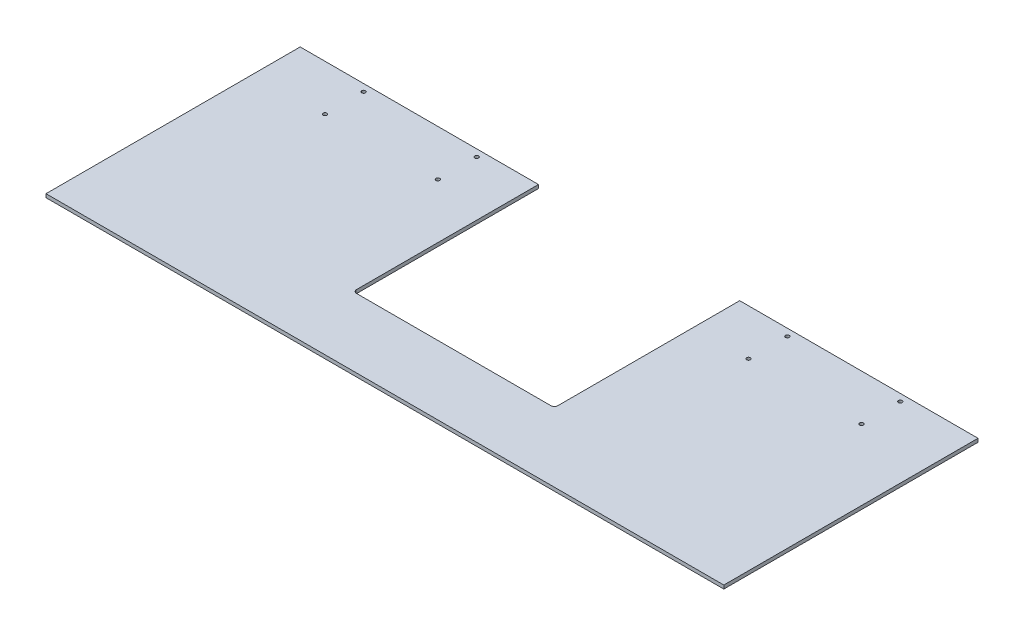
ISO-10303-21;
HEADER;
FILE_DESCRIPTION(('STEP AP214'),'2;1');
FILE_NAME('part.step','',(''),(''),'','','');
FILE_SCHEMA(('AUTOMOTIVE_DESIGN { 1 0 10303 214 1 1 1 1 }'));
ENDSEC;
DATA;
#1=APPLICATION_CONTEXT('core data for automotive mechanical design processes');
#2=APPLICATION_PROTOCOL_DEFINITION('international standard','automotive_design',2000,#1);
#3=PRODUCT_CONTEXT('',#1,'mechanical');
#4=PRODUCT('Part','Part','',(#3));
#5=PRODUCT_RELATED_PRODUCT_CATEGORY('part','',(#4));
#6=PRODUCT_DEFINITION_FORMATION('','',#4);
#7=PRODUCT_DEFINITION_CONTEXT('part definition',#1,'design');
#8=PRODUCT_DEFINITION('design','',#6,#7);
#9=PRODUCT_DEFINITION_SHAPE('','',#8);
#10=(LENGTH_UNIT() NAMED_UNIT(*) SI_UNIT(.MILLI.,.METRE.));
#11=(NAMED_UNIT(*) PLANE_ANGLE_UNIT() SI_UNIT($,.RADIAN.));
#12=(NAMED_UNIT(*) SI_UNIT($,.STERADIAN.) SOLID_ANGLE_UNIT());
#13=UNCERTAINTY_MEASURE_WITH_UNIT(LENGTH_MEASURE(1.E-05),#10,'distance_accuracy_value','');
#14=(GEOMETRIC_REPRESENTATION_CONTEXT(3) GLOBAL_UNCERTAINTY_ASSIGNED_CONTEXT((#13)) GLOBAL_UNIT_ASSIGNED_CONTEXT((#10,
#11,#12)) REPRESENTATION_CONTEXT('',''));
#15=CARTESIAN_POINT('',(0.,0.,0.));
#16=DIRECTION('',(0.,0.,1.));
#17=DIRECTION('',(1.,0.,0.));
#18=AXIS2_PLACEMENT_3D('',#15,#16,#17);
#19=CARTESIAN_POINT('',(609.6,-6.35,-432.563424110412));
#20=DIRECTION('',(0.,0.,1.));
#21=DIRECTION('',(1.,0.,0.));
#22=AXIS2_PLACEMENT_3D('',#19,#20,#21);
#23=PLANE('',#22);
#24=DIRECTION('',(0.,-1.,0.));
#25=VECTOR('',#24,1.);
#26=CARTESIAN_POINT('',(790.575,1340.49866482759,-432.563424110412));
#27=LINE('',#26,#25);
#28=CARTESIAN_POINT('',(790.575,0.,-432.563424110412));
#29=VERTEX_POINT('',#28);
#30=CARTESIAN_POINT('',(790.575,-6.35,-432.563424110412));
#31=VERTEX_POINT('',#30);
#32=EDGE_CURVE('E125',#29,#31,#27,.T.);
#33=ORIENTED_EDGE('',*,*,#32,.F.);
#34=DIRECTION('',(1.,0.,0.));
#35=VECTOR('',#34,1.);
#36=CARTESIAN_POINT('',(609.6,0.,-432.563424110412));
#37=LINE('',#36,#35);
#38=CARTESIAN_POINT('',(1219.2,0.,-432.563424110412));
#39=VERTEX_POINT('',#38);
#40=EDGE_CURVE('E165',#29,#39,#37,.T.);
#41=ORIENTED_EDGE('',*,*,#40,.T.);
#42=DIRECTION('',(0.,1.,0.));
#43=VECTOR('',#42,1.);
#44=CARTESIAN_POINT('',(1219.2,-6.35,-432.563424110412));
#45=LINE('',#44,#43);
#46=CARTESIAN_POINT('',(1219.2,-6.35,-432.563424110412));
#47=VERTEX_POINT('',#46);
#48=EDGE_CURVE('E175',#47,#39,#45,.T.);
#49=ORIENTED_EDGE('',*,*,#48,.F.);
#50=DIRECTION('',(1.,0.,0.));
#51=VECTOR('',#50,1.);
#52=CARTESIAN_POINT('',(609.6,-6.35,-432.563424110412));
#53=LINE('',#52,#51);
#54=EDGE_CURVE('E146',#31,#47,#53,.T.);
#55=ORIENTED_EDGE('',*,*,#54,.F.);
#56=EDGE_LOOP('',(#33,#41,#49,#55));
#57=FACE_BOUND('',#56,.T.);
#58=ADVANCED_FACE('F16',(#57),#23,.F.);
#59=CARTESIAN_POINT('',(609.6,-6.35,-203.963424110413));
#60=DIRECTION('',(0.,-1.,0.));
#61=DIRECTION('',(1.,0.,0.));
#62=AXIS2_PLACEMENT_3D('',#59,#60,#61);
#63=PLANE('',#62);
#64=CARTESIAN_POINT('',(1092.2,-6.35000000000008,-350.013424110413));
#65=DIRECTION('',(0.,-1.,0.));
#66=DIRECTION('',(0.,0.,-1.));
#67=AXIS2_PLACEMENT_3D('',#64,#65,#66);
#68=CIRCLE('',#67,3.36549999999991);
#69=CARTESIAN_POINT('',(1092.2,-6.35000000000008,-353.378924110413));
#70=VERTEX_POINT('',#69);
#71=EDGE_CURVE('E235',#70,#70,#68,.T.);
#72=ORIENTED_EDGE('',*,*,#71,.F.);
#73=EDGE_LOOP('',(#72));
#74=FACE_BOUND('',#73,.T.);
#75=CARTESIAN_POINT('',(1092.2,-6.35000000000008,-419.863424110413));
#76=DIRECTION('',(0.,-1.,0.));
#77=DIRECTION('',(0.,0.,-1.));
#78=AXIS2_PLACEMENT_3D('',#75,#76,#77);
#79=CIRCLE('',#78,3.36549999999991);
#80=CARTESIAN_POINT('',(1092.2,-6.35000000000008,-423.228924110413));
#81=VERTEX_POINT('',#80);
#82=EDGE_CURVE('E230',#81,#81,#79,.T.);
#83=ORIENTED_EDGE('',*,*,#82,.F.);
#84=EDGE_LOOP('',(#83));
#85=FACE_BOUND('',#84,.T.);
#86=CARTESIAN_POINT('',(889.,-6.35000000000008,-419.863424110412));
#87=DIRECTION('',(0.,-1.,0.));
#88=DIRECTION('',(0.,0.,-1.));
#89=AXIS2_PLACEMENT_3D('',#86,#87,#88);
#90=CIRCLE('',#89,3.3655);
#91=CARTESIAN_POINT('',(889.,-6.35000000000008,-423.228924110412));
#92=VERTEX_POINT('',#91);
#93=EDGE_CURVE('E225',#92,#92,#90,.T.);
#94=ORIENTED_EDGE('',*,*,#93,.F.);
#95=EDGE_LOOP('',(#94));
#96=FACE_BOUND('',#95,.T.);
#97=CARTESIAN_POINT('',(889.,-6.35000000000008,-350.013424110413));
#98=DIRECTION('',(0.,-1.,0.));
#99=DIRECTION('',(0.,0.,-1.));
#100=AXIS2_PLACEMENT_3D('',#97,#98,#99);
#101=CIRCLE('',#100,3.3655);
#102=CARTESIAN_POINT('',(889.,-6.35000000000008,-353.378924110413));
#103=VERTEX_POINT('',#102);
#104=EDGE_CURVE('E220',#103,#103,#101,.T.);
#105=ORIENTED_EDGE('',*,*,#104,.F.);
#106=EDGE_LOOP('',(#105));
#107=FACE_BOUND('',#106,.T.);
#108=CARTESIAN_POINT('',(330.2,-6.35000000000008,-350.013424110413));
#109=DIRECTION('',(0.,-1.,0.));
#110=DIRECTION('',(0.,0.,-1.));
#111=AXIS2_PLACEMENT_3D('',#108,#109,#110);
#112=CIRCLE('',#111,3.3655);
#113=CARTESIAN_POINT('',(330.2,-6.35000000000008,-353.378924110413));
#114=VERTEX_POINT('',#113);
#115=EDGE_CURVE('E215',#114,#114,#112,.T.);
#116=ORIENTED_EDGE('',*,*,#115,.F.);
#117=EDGE_LOOP('',(#116));
#118=FACE_BOUND('',#117,.T.);
#119=CARTESIAN_POINT('',(330.2,-6.35000000000008,-419.863424110412));
#120=DIRECTION('',(0.,-1.,0.));
#121=DIRECTION('',(0.,0.,-1.));
#122=AXIS2_PLACEMENT_3D('',#119,#120,#121);
#123=CIRCLE('',#122,3.3655);
#124=CARTESIAN_POINT('',(330.2,-6.35000000000008,-423.228924110412));
#125=VERTEX_POINT('',#124);
#126=EDGE_CURVE('E211',#125,#125,#123,.T.);
#127=ORIENTED_EDGE('',*,*,#126,.F.);
#128=EDGE_LOOP('',(#127));
#129=FACE_BOUND('',#128,.T.);
#130=CARTESIAN_POINT('',(127.,-6.35000000000008,-419.863424110412));
#131=DIRECTION('',(0.,-1.,0.));
#132=DIRECTION('',(0.,0.,-1.));
#133=AXIS2_PLACEMENT_3D('',#130,#131,#132);
#134=CIRCLE('',#133,3.3655);
#135=CARTESIAN_POINT('',(127.,-6.35000000000008,-423.228924110412));
#136=VERTEX_POINT('',#135);
#137=EDGE_CURVE('E206',#136,#136,#134,.T.);
#138=ORIENTED_EDGE('',*,*,#137,.F.);
#139=EDGE_LOOP('',(#138));
#140=FACE_BOUND('',#139,.T.);
#141=CARTESIAN_POINT('',(127.,-6.35000000000008,-350.013424110413));
#142=DIRECTION('',(0.,-1.,0.));
#143=DIRECTION('',(0.,0.,-1.));
#144=AXIS2_PLACEMENT_3D('',#141,#142,#143);
#145=CIRCLE('',#144,3.3655);
#146=CARTESIAN_POINT('',(127.,-6.35000000000008,-353.378924110413));
#147=VERTEX_POINT('',#146);
#148=EDGE_CURVE('E201',#147,#147,#145,.T.);
#149=ORIENTED_EDGE('',*,*,#148,.F.);
#150=EDGE_LOOP('',(#149));
#151=FACE_BOUND('',#150,.T.);
#152=DIRECTION('',(0.,0.,1.));
#153=VECTOR('',#152,1.);
#154=CARTESIAN_POINT('',(428.625,-6.35,-282.531552016735));
#155=LINE('',#154,#153);
#156=CARTESIAN_POINT('',(428.625,-6.35,-432.563424110412));
#157=VERTEX_POINT('',#156);
#158=CARTESIAN_POINT('',(428.625,-6.35,-105.538424110413));
#159=VERTEX_POINT('',#158);
#160=EDGE_CURVE('E117',#157,#159,#155,.T.);
#161=ORIENTED_EDGE('',*,*,#160,.T.);
#162=CARTESIAN_POINT('',(434.975,-6.35000000000008,-105.538424110413));
#163=DIRECTION('',(0.,-1.,0.));
#164=DIRECTION('',(0.,0.,-1.));
#165=AXIS2_PLACEMENT_3D('',#162,#163,#164);
#166=CIRCLE('',#165,6.35);
#167=CARTESIAN_POINT('',(434.975,-6.35,-99.1884241104126));
#168=VERTEX_POINT('',#167);
#169=EDGE_CURVE('E25',#159,#168,#166,.F.);
#170=ORIENTED_EDGE('',*,*,#169,.T.);
#171=DIRECTION('',(1.,0.,0.));
#172=VECTOR('',#171,1.);
#173=CARTESIAN_POINT('',(475.085129356384,-6.35,-99.1884241104126));
#174=LINE('',#173,#172);
#175=CARTESIAN_POINT('',(784.225,-6.35,-99.1884241104126));
#176=VERTEX_POINT('',#175);
#177=EDGE_CURVE('E126',#168,#176,#174,.T.);
#178=ORIENTED_EDGE('',*,*,#177,.T.);
#179=CARTESIAN_POINT('',(784.225,-6.35000000000008,-105.538424110413));
#180=DIRECTION('',(0.,-1.,0.));
#181=DIRECTION('',(0.,0.,-1.));
#182=AXIS2_PLACEMENT_3D('',#179,#180,#181);
#183=CIRCLE('',#182,6.35);
#184=CARTESIAN_POINT('',(790.575,-6.35,-105.538424110413));
#185=VERTEX_POINT('',#184);
#186=EDGE_CURVE('E247',#176,#185,#183,.F.);
#187=ORIENTED_EDGE('',*,*,#186,.T.);
#188=DIRECTION('',(0.,0.,-1.));
#189=VECTOR('',#188,1.);
#190=CARTESIAN_POINT('',(790.575,-6.35,-258.876107633114));
#191=LINE('',#190,#189);
#192=EDGE_CURVE('E200',#185,#31,#191,.T.);
#193=ORIENTED_EDGE('',*,*,#192,.T.);
#194=ORIENTED_EDGE('',*,*,#54,.T.);
#195=DIRECTION('',(0.,0.,-1.));
#196=VECTOR('',#195,1.);
#197=CARTESIAN_POINT('',(1219.2,-6.35,-203.963424110413));
#198=LINE('',#197,#196);
#199=CARTESIAN_POINT('',(1219.2,-6.35,24.6365758895875));
#200=VERTEX_POINT('',#199);
#201=EDGE_CURVE('E145',#200,#47,#198,.T.);
#202=ORIENTED_EDGE('',*,*,#201,.F.);
#203=DIRECTION('',(1.,0.,0.));
#204=VECTOR('',#203,1.);
#205=CARTESIAN_POINT('',(609.6,-6.35,24.6365758895875));
#206=LINE('',#205,#204);
#207=CARTESIAN_POINT('',(0.,-6.35,24.6365758895875));
#208=VERTEX_POINT('',#207);
#209=EDGE_CURVE('E172',#208,#200,#206,.T.);
#210=ORIENTED_EDGE('',*,*,#209,.F.);
#211=DIRECTION('',(0.,0.,-1.));
#212=VECTOR('',#211,1.);
#213=CARTESIAN_POINT('',(0.,-6.35,-203.963424110413));
#214=LINE('',#213,#212);
#215=CARTESIAN_POINT('',(0.,-6.35,-432.563424110412));
#216=VERTEX_POINT('',#215);
#217=EDGE_CURVE('E142',#208,#216,#214,.T.);
#218=ORIENTED_EDGE('',*,*,#217,.T.);
#219=EDGE_CURVE('E133',#216,#157,#53,.T.);
#220=ORIENTED_EDGE('',*,*,#219,.T.);
#221=EDGE_LOOP('',(#161,#170,#178,#187,#193,#194,#202,#210,#218,#220));
#222=FACE_BOUND('',#221,.T.);
#223=ADVANCED_FACE('F139',(#74,#85,#96,#107,#118,#129,#140,#151,#222),#63,.T.);
#224=CARTESIAN_POINT('',(609.6,0.,-203.963424110413));
#225=DIRECTION('',(0.,-1.,0.));
#226=DIRECTION('',(1.,0.,0.));
#227=AXIS2_PLACEMENT_3D('',#224,#225,#226);
#228=PLANE('',#227);
#229=CARTESIAN_POINT('',(1092.2,0.,-350.013424110413));
#230=DIRECTION('',(0.,-1.,0.));
#231=DIRECTION('',(0.,0.,-1.));
#232=AXIS2_PLACEMENT_3D('',#229,#230,#231);
#233=CIRCLE('',#232,3.36549999999991);
#234=CARTESIAN_POINT('',(1092.2,0.,-353.378924110413));
#235=VERTEX_POINT('',#234);
#236=EDGE_CURVE('E231',#235,#235,#233,.F.);
#237=ORIENTED_EDGE('',*,*,#236,.F.);
#238=EDGE_LOOP('',(#237));
#239=FACE_BOUND('',#238,.T.);
#240=CARTESIAN_POINT('',(1092.2,0.,-419.863424110413));
#241=DIRECTION('',(0.,-1.,0.));
#242=DIRECTION('',(0.,0.,-1.));
#243=AXIS2_PLACEMENT_3D('',#240,#241,#242);
#244=CIRCLE('',#243,3.36549999999991);
#245=CARTESIAN_POINT('',(1092.2,0.,-423.228924110413));
#246=VERTEX_POINT('',#245);
#247=EDGE_CURVE('E226',#246,#246,#244,.F.);
#248=ORIENTED_EDGE('',*,*,#247,.F.);
#249=EDGE_LOOP('',(#248));
#250=FACE_BOUND('',#249,.T.);
#251=CARTESIAN_POINT('',(889.,0.,-419.863424110412));
#252=DIRECTION('',(0.,-1.,0.));
#253=DIRECTION('',(0.,0.,-1.));
#254=AXIS2_PLACEMENT_3D('',#251,#252,#253);
#255=CIRCLE('',#254,3.3655);
#256=CARTESIAN_POINT('',(889.,0.,-423.228924110412));
#257=VERTEX_POINT('',#256);
#258=EDGE_CURVE('E221',#257,#257,#255,.F.);
#259=ORIENTED_EDGE('',*,*,#258,.F.);
#260=EDGE_LOOP('',(#259));
#261=FACE_BOUND('',#260,.T.);
#262=CARTESIAN_POINT('',(889.,0.,-350.013424110413));
#263=DIRECTION('',(0.,-1.,0.));
#264=DIRECTION('',(0.,0.,-1.));
#265=AXIS2_PLACEMENT_3D('',#262,#263,#264);
#266=CIRCLE('',#265,3.3655);
#267=CARTESIAN_POINT('',(889.,0.,-353.378924110413));
#268=VERTEX_POINT('',#267);
#269=EDGE_CURVE('E216',#268,#268,#266,.F.);
#270=ORIENTED_EDGE('',*,*,#269,.F.);
#271=EDGE_LOOP('',(#270));
#272=FACE_BOUND('',#271,.T.);
#273=CARTESIAN_POINT('',(330.2,0.,-350.013424110413));
#274=DIRECTION('',(0.,-1.,0.));
#275=DIRECTION('',(0.,0.,-1.));
#276=AXIS2_PLACEMENT_3D('',#273,#274,#275);
#277=CIRCLE('',#276,3.3655);
#278=CARTESIAN_POINT('',(330.2,0.,-353.378924110413));
#279=VERTEX_POINT('',#278);
#280=EDGE_CURVE('E212',#279,#279,#277,.F.);
#281=ORIENTED_EDGE('',*,*,#280,.F.);
#282=EDGE_LOOP('',(#281));
#283=FACE_BOUND('',#282,.T.);
#284=CARTESIAN_POINT('',(330.2,0.,-419.863424110412));
#285=DIRECTION('',(0.,-1.,0.));
#286=DIRECTION('',(0.,0.,-1.));
#287=AXIS2_PLACEMENT_3D('',#284,#285,#286);
#288=CIRCLE('',#287,3.3655);
#289=CARTESIAN_POINT('',(330.2,0.,-423.228924110412));
#290=VERTEX_POINT('',#289);
#291=EDGE_CURVE('E207',#290,#290,#288,.F.);
#292=ORIENTED_EDGE('',*,*,#291,.F.);
#293=EDGE_LOOP('',(#292));
#294=FACE_BOUND('',#293,.T.);
#295=CARTESIAN_POINT('',(127.,0.,-419.863424110412));
#296=DIRECTION('',(0.,-1.,0.));
#297=DIRECTION('',(0.,0.,-1.));
#298=AXIS2_PLACEMENT_3D('',#295,#296,#297);
#299=CIRCLE('',#298,3.3655);
#300=CARTESIAN_POINT('',(127.,0.,-423.228924110412));
#301=VERTEX_POINT('',#300);
#302=EDGE_CURVE('E202',#301,#301,#299,.F.);
#303=ORIENTED_EDGE('',*,*,#302,.F.);
#304=EDGE_LOOP('',(#303));
#305=FACE_BOUND('',#304,.T.);
#306=CARTESIAN_POINT('',(127.,0.,-350.013424110413));
#307=DIRECTION('',(0.,-1.,0.));
#308=DIRECTION('',(0.,0.,-1.));
#309=AXIS2_PLACEMENT_3D('',#306,#307,#308);
#310=CIRCLE('',#309,3.3655);
#311=CARTESIAN_POINT('',(127.,0.,-353.378924110413));
#312=VERTEX_POINT('',#311);
#313=EDGE_CURVE('E196',#312,#312,#310,.F.);
#314=ORIENTED_EDGE('',*,*,#313,.F.);
#315=EDGE_LOOP('',(#314));
#316=FACE_BOUND('',#315,.T.);
#317=DIRECTION('',(0.,0.,-1.));
#318=VECTOR('',#317,1.);
#319=CARTESIAN_POINT('',(790.575,0.,-203.963424110413));
#320=LINE('',#319,#318);
#321=CARTESIAN_POINT('',(790.575,0.,-105.538424110413));
#322=VERTEX_POINT('',#321);
#323=EDGE_CURVE('E192',#322,#29,#320,.T.);
#324=ORIENTED_EDGE('',*,*,#323,.F.);
#325=CARTESIAN_POINT('',(784.225,0.,-105.538424110413));
#326=DIRECTION('',(0.,-1.,0.));
#327=DIRECTION('',(0.,0.,-1.));
#328=AXIS2_PLACEMENT_3D('',#325,#326,#327);
#329=CIRCLE('',#328,6.35);
#330=CARTESIAN_POINT('',(784.225,0.,-99.1884241104126));
#331=VERTEX_POINT('',#330);
#332=EDGE_CURVE('E250',#322,#331,#329,.T.);
#333=ORIENTED_EDGE('',*,*,#332,.T.);
#334=DIRECTION('',(1.,0.,0.));
#335=VECTOR('',#334,1.);
#336=CARTESIAN_POINT('',(609.6,0.,-99.1884241104126));
#337=LINE('',#336,#335);
#338=CARTESIAN_POINT('',(434.975,0.,-99.1884241104126));
#339=VERTEX_POINT('',#338);
#340=EDGE_CURVE('E188',#339,#331,#337,.T.);
#341=ORIENTED_EDGE('',*,*,#340,.F.);
#342=CARTESIAN_POINT('',(434.975,0.,-105.538424110413));
#343=DIRECTION('',(0.,-1.,0.));
#344=DIRECTION('',(0.,0.,-1.));
#345=AXIS2_PLACEMENT_3D('',#342,#343,#344);
#346=CIRCLE('',#345,6.35);
#347=CARTESIAN_POINT('',(428.625,0.,-105.538424110413));
#348=VERTEX_POINT('',#347);
#349=EDGE_CURVE('E11',#339,#348,#346,.T.);
#350=ORIENTED_EDGE('',*,*,#349,.T.);
#351=DIRECTION('',(0.,0.,1.));
#352=VECTOR('',#351,1.);
#353=CARTESIAN_POINT('',(428.625,0.,-203.963424110413));
#354=LINE('',#353,#352);
#355=CARTESIAN_POINT('',(428.625,0.,-432.563424110412));
#356=VERTEX_POINT('',#355);
#357=EDGE_CURVE('E185',#356,#348,#354,.T.);
#358=ORIENTED_EDGE('',*,*,#357,.F.);
#359=CARTESIAN_POINT('',(0.,0.,-432.563424110412));
#360=VERTEX_POINT('',#359);
#361=EDGE_CURVE('E135',#360,#356,#37,.T.);
#362=ORIENTED_EDGE('',*,*,#361,.F.);
#363=DIRECTION('',(0.,0.,-1.));
#364=VECTOR('',#363,1.);
#365=CARTESIAN_POINT('',(0.,0.,-203.963424110413));
#366=LINE('',#365,#364);
#367=CARTESIAN_POINT('',(0.,0.,24.6365758895875));
#368=VERTEX_POINT('',#367);
#369=EDGE_CURVE('E162',#368,#360,#366,.T.);
#370=ORIENTED_EDGE('',*,*,#369,.F.);
#371=DIRECTION('',(1.,0.,0.));
#372=VECTOR('',#371,1.);
#373=CARTESIAN_POINT('',(609.6,0.,24.6365758895875));
#374=LINE('',#373,#372);
#375=CARTESIAN_POINT('',(1219.2,0.,24.6365758895875));
#376=VERTEX_POINT('',#375);
#377=EDGE_CURVE('E137',#368,#376,#374,.T.);
#378=ORIENTED_EDGE('',*,*,#377,.T.);
#379=DIRECTION('',(0.,0.,-1.));
#380=VECTOR('',#379,1.);
#381=CARTESIAN_POINT('',(1219.2,0.,-203.963424110413));
#382=LINE('',#381,#380);
#383=EDGE_CURVE('E168',#376,#39,#382,.T.);
#384=ORIENTED_EDGE('',*,*,#383,.T.);
#385=ORIENTED_EDGE('',*,*,#40,.F.);
#386=EDGE_LOOP('',(#324,#333,#341,#350,#358,#362,#370,#378,#384,#385));
#387=FACE_BOUND('',#386,.T.);
#388=ADVANCED_FACE('F276',(#239,#250,#261,#272,#283,#294,#305,#316,#387),#228,.F.);
#389=CARTESIAN_POINT('',(609.6,-6.35,24.6365758895875));
#390=DIRECTION('',(0.,0.,1.));
#391=DIRECTION('',(1.,0.,0.));
#392=AXIS2_PLACEMENT_3D('',#389,#390,#391);
#393=PLANE('',#392);
#394=ORIENTED_EDGE('',*,*,#377,.F.);
#395=DIRECTION('',(0.,1.,0.));
#396=VECTOR('',#395,1.);
#397=CARTESIAN_POINT('',(0.,-6.35,24.6365758895875));
#398=LINE('',#397,#396);
#399=EDGE_CURVE('E182',#208,#368,#398,.T.);
#400=ORIENTED_EDGE('',*,*,#399,.F.);
#401=ORIENTED_EDGE('',*,*,#209,.T.);
#402=DIRECTION('',(0.,1.,0.));
#403=VECTOR('',#402,1.);
#404=CARTESIAN_POINT('',(1219.2,-6.35,24.6365758895875));
#405=LINE('',#404,#403);
#406=EDGE_CURVE('E153',#200,#376,#405,.T.);
#407=ORIENTED_EDGE('',*,*,#406,.T.);
#408=EDGE_LOOP('',(#394,#400,#401,#407));
#409=FACE_BOUND('',#408,.T.);
#410=ADVANCED_FACE('F291',(#409),#393,.T.);
#411=CARTESIAN_POINT('',(0.,-6.35,-203.963424110413));
#412=DIRECTION('',(1.,0.,0.));
#413=DIRECTION('',(0.,0.,-1.));
#414=AXIS2_PLACEMENT_3D('',#411,#412,#413);
#415=PLANE('',#414);
#416=ORIENTED_EDGE('',*,*,#369,.T.);
#417=DIRECTION('',(0.,1.,0.));
#418=VECTOR('',#417,1.);
#419=CARTESIAN_POINT('',(0.,-6.35,-432.563424110412));
#420=LINE('',#419,#418);
#421=EDGE_CURVE('E179',#216,#360,#420,.T.);
#422=ORIENTED_EDGE('',*,*,#421,.F.);
#423=ORIENTED_EDGE('',*,*,#217,.F.);
#424=ORIENTED_EDGE('',*,*,#399,.T.);
#425=EDGE_LOOP('',(#416,#422,#423,#424));
#426=FACE_BOUND('',#425,.T.);
#427=ADVANCED_FACE('F284',(#426),#415,.F.);
#428=ORIENTED_EDGE('',*,*,#361,.T.);
#429=DIRECTION('',(0.,-1.,0.));
#430=VECTOR('',#429,1.);
#431=CARTESIAN_POINT('',(428.625,1340.49866482759,-432.563424110412));
#432=LINE('',#431,#430);
#433=EDGE_CURVE('E120',#356,#157,#432,.T.);
#434=ORIENTED_EDGE('',*,*,#433,.T.);
#435=ORIENTED_EDGE('',*,*,#219,.F.);
#436=ORIENTED_EDGE('',*,*,#421,.T.);
#437=EDGE_LOOP('',(#428,#434,#435,#436));
#438=FACE_BOUND('',#437,.T.);
#439=ADVANCED_FACE('F131',(#438),#23,.F.);
#440=CARTESIAN_POINT('',(1219.2,-6.35,-203.963424110413));
#441=DIRECTION('',(1.,0.,0.));
#442=DIRECTION('',(0.,0.,-1.));
#443=AXIS2_PLACEMENT_3D('',#440,#441,#442);
#444=PLANE('',#443);
#445=ORIENTED_EDGE('',*,*,#383,.F.);
#446=ORIENTED_EDGE('',*,*,#406,.F.);
#447=ORIENTED_EDGE('',*,*,#201,.T.);
#448=ORIENTED_EDGE('',*,*,#48,.T.);
#449=EDGE_LOOP('',(#445,#446,#447,#448));
#450=FACE_BOUND('',#449,.T.);
#451=ADVANCED_FACE('F283',(#450),#444,.T.);
#452=CARTESIAN_POINT('',(790.575,1340.49866482759,-258.876107633114));
#453=DIRECTION('',(-1.,0.,0.));
#454=DIRECTION('',(0.,0.,1.));
#455=AXIS2_PLACEMENT_3D('',#452,#453,#454);
#456=PLANE('',#455);
#457=ORIENTED_EDGE('',*,*,#192,.F.);
#458=DIRECTION('',(0.,-1.,0.));
#459=VECTOR('',#458,1.);
#460=CARTESIAN_POINT('',(790.575,0.,-105.538424110413));
#461=LINE('',#460,#459);
#462=EDGE_CURVE('E242',#185,#322,#461,.F.);
#463=ORIENTED_EDGE('',*,*,#462,.T.);
#464=ORIENTED_EDGE('',*,*,#323,.T.);
#465=ORIENTED_EDGE('',*,*,#32,.T.);
#466=EDGE_LOOP('',(#457,#463,#464,#465));
#467=FACE_BOUND('',#466,.T.);
#468=ADVANCED_FACE('F289',(#467),#456,.T.);
#469=CARTESIAN_POINT('',(475.085129356384,1340.49866482759,-99.1884241104126));
#470=DIRECTION('',(0.,0.,-1.));
#471=DIRECTION('',(-1.,0.,0.));
#472=AXIS2_PLACEMENT_3D('',#469,#470,#471);
#473=PLANE('',#472);
#474=ORIENTED_EDGE('',*,*,#340,.T.);
#475=DIRECTION('',(0.,-1.,0.));
#476=VECTOR('',#475,1.);
#477=CARTESIAN_POINT('',(784.225,-6.35000000000008,-99.1884241104126));
#478=LINE('',#477,#476);
#479=EDGE_CURVE('E238',#331,#176,#478,.T.);
#480=ORIENTED_EDGE('',*,*,#479,.T.);
#481=ORIENTED_EDGE('',*,*,#177,.F.);
#482=DIRECTION('',(0.,-1.,0.));
#483=VECTOR('',#482,1.);
#484=CARTESIAN_POINT('',(434.975,0.,-99.1884241104126));
#485=LINE('',#484,#483);
#486=EDGE_CURVE('E195',#168,#339,#485,.F.);
#487=ORIENTED_EDGE('',*,*,#486,.T.);
#488=EDGE_LOOP('',(#474,#480,#481,#487));
#489=FACE_BOUND('',#488,.T.);
#490=ADVANCED_FACE('F257',(#489),#473,.T.);
#491=CARTESIAN_POINT('',(428.625,1340.49866482759,-282.531552016735));
#492=DIRECTION('',(1.,0.,0.));
#493=DIRECTION('',(0.,0.,-1.));
#494=AXIS2_PLACEMENT_3D('',#491,#492,#493);
#495=PLANE('',#494);
#496=ORIENTED_EDGE('',*,*,#357,.T.);
#497=DIRECTION('',(0.,-1.,0.));
#498=VECTOR('',#497,1.);
#499=CARTESIAN_POINT('',(428.625,-6.35000000000008,-105.538424110413));
#500=LINE('',#499,#498);
#501=EDGE_CURVE('E121',#348,#159,#500,.T.);
#502=ORIENTED_EDGE('',*,*,#501,.T.);
#503=ORIENTED_EDGE('',*,*,#160,.F.);
#504=ORIENTED_EDGE('',*,*,#433,.F.);
#505=EDGE_LOOP('',(#496,#502,#503,#504));
#506=FACE_BOUND('',#505,.T.);
#507=ADVANCED_FACE('F119',(#506),#495,.T.);
#508=CARTESIAN_POINT('',(127.,1296.78275246943,-350.013424110413));
#509=DIRECTION('',(0.,-1.,0.));
#510=DIRECTION('',(0.,0.,-1.));
#511=AXIS2_PLACEMENT_3D('',#508,#509,#510);
#512=CYLINDRICAL_SURFACE('',#511,3.3655);
#513=ORIENTED_EDGE('',*,*,#148,.T.);
#514=EDGE_LOOP('',(#513));
#515=FACE_BOUND('',#514,.T.);
#516=ORIENTED_EDGE('',*,*,#313,.T.);
#517=EDGE_LOOP('',(#516));
#518=FACE_BOUND('',#517,.T.);
#519=ADVANCED_FACE('F318',(#515,#518),#512,.F.);
#520=CARTESIAN_POINT('',(127.,1296.78275246943,-419.863424110412));
#521=DIRECTION('',(0.,-1.,0.));
#522=DIRECTION('',(0.,0.,-1.));
#523=AXIS2_PLACEMENT_3D('',#520,#521,#522);
#524=CYLINDRICAL_SURFACE('',#523,3.3655);
#525=ORIENTED_EDGE('',*,*,#137,.T.);
#526=EDGE_LOOP('',(#525));
#527=FACE_BOUND('',#526,.T.);
#528=ORIENTED_EDGE('',*,*,#302,.T.);
#529=EDGE_LOOP('',(#528));
#530=FACE_BOUND('',#529,.T.);
#531=ADVANCED_FACE('F321',(#527,#530),#524,.F.);
#532=CARTESIAN_POINT('',(330.2,1296.78275246943,-419.863424110412));
#533=DIRECTION('',(0.,-1.,0.));
#534=DIRECTION('',(0.,0.,-1.));
#535=AXIS2_PLACEMENT_3D('',#532,#533,#534);
#536=CYLINDRICAL_SURFACE('',#535,3.3655);
#537=ORIENTED_EDGE('',*,*,#126,.T.);
#538=EDGE_LOOP('',(#537));
#539=FACE_BOUND('',#538,.T.);
#540=ORIENTED_EDGE('',*,*,#291,.T.);
#541=EDGE_LOOP('',(#540));
#542=FACE_BOUND('',#541,.T.);
#543=ADVANCED_FACE('F325',(#539,#542),#536,.F.);
#544=CARTESIAN_POINT('',(330.2,1296.78275246943,-350.013424110413));
#545=DIRECTION('',(0.,-1.,0.));
#546=DIRECTION('',(0.,0.,-1.));
#547=AXIS2_PLACEMENT_3D('',#544,#545,#546);
#548=CYLINDRICAL_SURFACE('',#547,3.3655);
#549=ORIENTED_EDGE('',*,*,#115,.T.);
#550=EDGE_LOOP('',(#549));
#551=FACE_BOUND('',#550,.T.);
#552=ORIENTED_EDGE('',*,*,#280,.T.);
#553=EDGE_LOOP('',(#552));
#554=FACE_BOUND('',#553,.T.);
#555=ADVANCED_FACE('F329',(#551,#554),#548,.F.);
#556=CARTESIAN_POINT('',(889.,1296.78275246943,-350.013424110413));
#557=DIRECTION('',(0.,-1.,0.));
#558=DIRECTION('',(0.,0.,-1.));
#559=AXIS2_PLACEMENT_3D('',#556,#557,#558);
#560=CYLINDRICAL_SURFACE('',#559,3.3655);
#561=ORIENTED_EDGE('',*,*,#104,.T.);
#562=EDGE_LOOP('',(#561));
#563=FACE_BOUND('',#562,.T.);
#564=ORIENTED_EDGE('',*,*,#269,.T.);
#565=EDGE_LOOP('',(#564));
#566=FACE_BOUND('',#565,.T.);
#567=ADVANCED_FACE('F333',(#563,#566),#560,.F.);
#568=CARTESIAN_POINT('',(889.,1296.78275246943,-419.863424110412));
#569=DIRECTION('',(0.,-1.,0.));
#570=DIRECTION('',(0.,0.,-1.));
#571=AXIS2_PLACEMENT_3D('',#568,#569,#570);
#572=CYLINDRICAL_SURFACE('',#571,3.3655);
#573=ORIENTED_EDGE('',*,*,#93,.T.);
#574=EDGE_LOOP('',(#573));
#575=FACE_BOUND('',#574,.T.);
#576=ORIENTED_EDGE('',*,*,#258,.T.);
#577=EDGE_LOOP('',(#576));
#578=FACE_BOUND('',#577,.T.);
#579=ADVANCED_FACE('F337',(#575,#578),#572,.F.);
#580=CARTESIAN_POINT('',(1092.2,1296.78275246943,-419.863424110413));
#581=DIRECTION('',(0.,-1.,0.));
#582=DIRECTION('',(0.,0.,-1.));
#583=AXIS2_PLACEMENT_3D('',#580,#581,#582);
#584=CYLINDRICAL_SURFACE('',#583,3.36549999999991);
#585=ORIENTED_EDGE('',*,*,#82,.T.);
#586=EDGE_LOOP('',(#585));
#587=FACE_BOUND('',#586,.T.);
#588=ORIENTED_EDGE('',*,*,#247,.T.);
#589=EDGE_LOOP('',(#588));
#590=FACE_BOUND('',#589,.T.);
#591=ADVANCED_FACE('F341',(#587,#590),#584,.F.);
#592=CARTESIAN_POINT('',(1092.2,1296.78275246943,-350.013424110413));
#593=DIRECTION('',(0.,-1.,0.));
#594=DIRECTION('',(0.,0.,-1.));
#595=AXIS2_PLACEMENT_3D('',#592,#593,#594);
#596=CYLINDRICAL_SURFACE('',#595,3.36549999999991);
#597=ORIENTED_EDGE('',*,*,#71,.T.);
#598=EDGE_LOOP('',(#597));
#599=FACE_BOUND('',#598,.T.);
#600=ORIENTED_EDGE('',*,*,#236,.T.);
#601=EDGE_LOOP('',(#600));
#602=FACE_BOUND('',#601,.T.);
#603=ADVANCED_FACE('F267',(#599,#602),#596,.F.);
#604=CARTESIAN_POINT('',(784.225,1340.49866482759,-105.538424110413));
#605=DIRECTION('',(0.,1.,0.));
#606=DIRECTION('',(0.,0.,1.));
#607=AXIS2_PLACEMENT_3D('',#604,#605,#606);
#608=CYLINDRICAL_SURFACE('',#607,6.35);
#609=ORIENTED_EDGE('',*,*,#332,.F.);
#610=ORIENTED_EDGE('',*,*,#462,.F.);
#611=ORIENTED_EDGE('',*,*,#186,.F.);
#612=ORIENTED_EDGE('',*,*,#479,.F.);
#613=EDGE_LOOP('',(#609,#610,#611,#612));
#614=FACE_BOUND('',#613,.T.);
#615=ADVANCED_FACE('F262',(#614),#608,.F.);
#616=CARTESIAN_POINT('',(434.975,1340.49866482759,-105.538424110413));
#617=DIRECTION('',(0.,1.,0.));
#618=DIRECTION('',(0.,0.,1.));
#619=AXIS2_PLACEMENT_3D('',#616,#617,#618);
#620=CYLINDRICAL_SURFACE('',#619,6.35);
#621=ORIENTED_EDGE('',*,*,#349,.F.);
#622=ORIENTED_EDGE('',*,*,#486,.F.);
#623=ORIENTED_EDGE('',*,*,#169,.F.);
#624=ORIENTED_EDGE('',*,*,#501,.F.);
#625=EDGE_LOOP('',(#621,#622,#623,#624));
#626=FACE_BOUND('',#625,.T.);
#627=ADVANCED_FACE('F18',(#626),#620,.F.);
#628=CLOSED_SHELL('',(#58,#223,#388,#410,#427,#439,#451,#468,#490,#507,#519,#531,#543,#555,#567,
#579,#591,#603,#615,#627));
#629=MANIFOLD_SOLID_BREP('B1',#628);
#630=ADVANCED_BREP_SHAPE_REPRESENTATION('',(#18,#629),#14);
#631=SHAPE_DEFINITION_REPRESENTATION(#9,#630);
ENDSEC;
END-ISO-10303-21;
